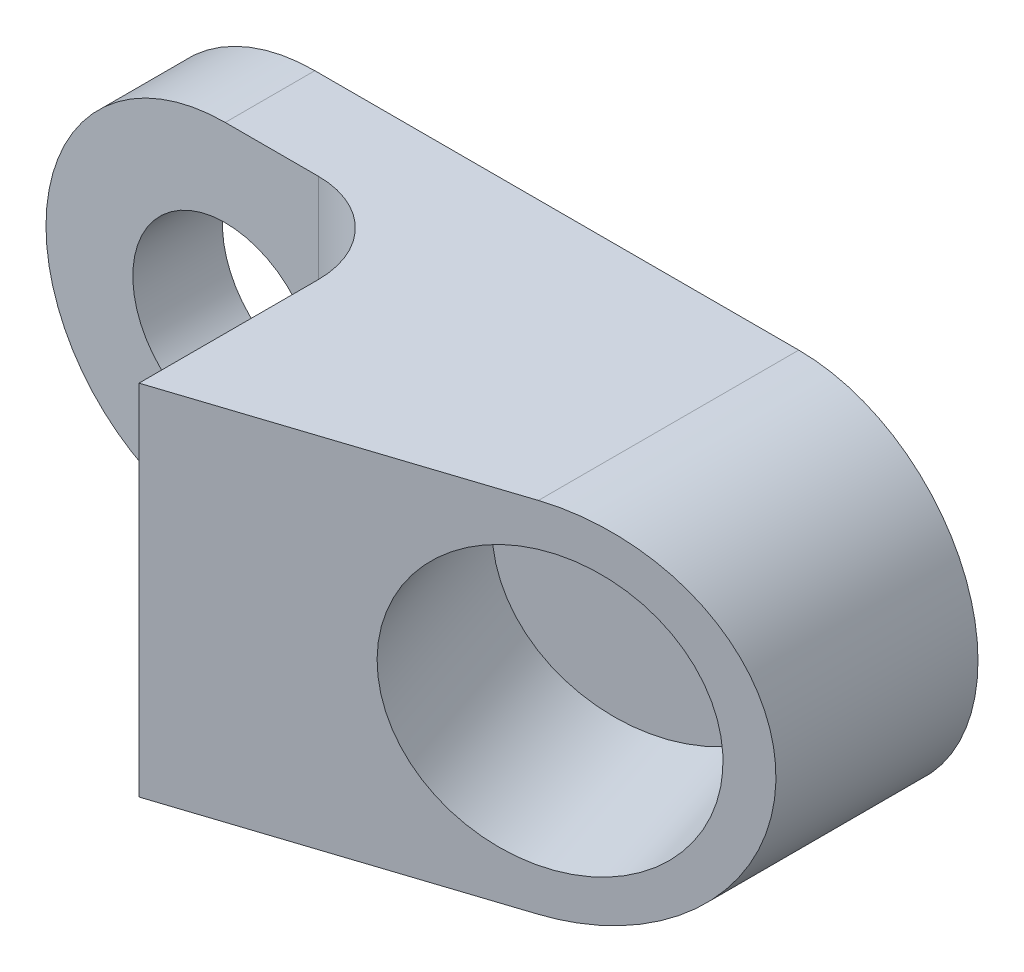
ISO-10303-21;
HEADER;
FILE_DESCRIPTION(('STEP AP214'),'2;1');
FILE_NAME('part.step','',(''),(''),'','','');
FILE_SCHEMA(('AUTOMOTIVE_DESIGN { 1 0 10303 214 1 1 1 1 }'));
ENDSEC;
DATA;
#1=APPLICATION_CONTEXT('core data for automotive mechanical design processes');
#2=APPLICATION_PROTOCOL_DEFINITION('international standard','automotive_design',2000,#1);
#3=PRODUCT_CONTEXT('',#1,'mechanical');
#4=PRODUCT('Part','Part','',(#3));
#5=PRODUCT_RELATED_PRODUCT_CATEGORY('part','',(#4));
#6=PRODUCT_DEFINITION_FORMATION('','',#4);
#7=PRODUCT_DEFINITION_CONTEXT('part definition',#1,'design');
#8=PRODUCT_DEFINITION('design','',#6,#7);
#9=PRODUCT_DEFINITION_SHAPE('','',#8);
#10=(LENGTH_UNIT() NAMED_UNIT(*) SI_UNIT(.MILLI.,.METRE.));
#11=(NAMED_UNIT(*) PLANE_ANGLE_UNIT() SI_UNIT($,.RADIAN.));
#12=(NAMED_UNIT(*) SI_UNIT($,.STERADIAN.) SOLID_ANGLE_UNIT());
#13=UNCERTAINTY_MEASURE_WITH_UNIT(LENGTH_MEASURE(1.E-05),#10,'distance_accuracy_value','');
#14=(GEOMETRIC_REPRESENTATION_CONTEXT(3) GLOBAL_UNCERTAINTY_ASSIGNED_CONTEXT((#13)) GLOBAL_UNIT_ASSIGNED_CONTEXT((#10,
#11,#12)) REPRESENTATION_CONTEXT('',''));
#15=CARTESIAN_POINT('',(0.,0.,0.));
#16=DIRECTION('',(0.,0.,1.));
#17=DIRECTION('',(1.,0.,0.));
#18=AXIS2_PLACEMENT_3D('',#15,#16,#17);
#19=CARTESIAN_POINT('',(21.3482169376562,12.7,0.));
#20=DIRECTION('',(0.,0.,1.));
#21=DIRECTION('',(-0.484934330020351,-0.874550567759071,0.));
#22=AXIS2_PLACEMENT_3D('',#19,#20,#21);
#23=CYLINDRICAL_SURFACE('',#22,12.7);
#24=DIRECTION('',(0.,0.,-1.));
#25=VECTOR('',#24,1.);
#26=CARTESIAN_POINT('',(21.3482169376562,0.,0.));
#27=LINE('',#26,#25);
#28=CARTESIAN_POINT('',(21.3482169376561,0.,0.));
#29=VERTEX_POINT('',#28);
#30=CARTESIAN_POINT('',(21.3482169376562,0.,18.4503189580246));
#31=VERTEX_POINT('',#30);
#32=EDGE_CURVE('E120',#29,#31,#27,.F.);
#33=ORIENTED_EDGE('',*,*,#32,.F.);
#34=CARTESIAN_POINT('',(21.3482169376562,12.7,0.));
#35=DIRECTION('',(0.,0.,1.));
#36=DIRECTION('',(0.874550567759071,-0.484934330020351,0.));
#37=AXIS2_PLACEMENT_3D('',#34,#35,#36);
#38=CIRCLE('',#37,12.7);
#39=CARTESIAN_POINT('',(21.3482169376561,25.4,0.));
#40=VERTEX_POINT('',#39);
#41=EDGE_CURVE('E158',#40,#29,#38,.F.);
#42=ORIENTED_EDGE('',*,*,#41,.F.);
#43=DIRECTION('',(0.,0.,1.));
#44=VECTOR('',#43,1.);
#45=CARTESIAN_POINT('',(21.3482169376561,25.4,-3.17499999999996));
#46=LINE('',#45,#44);
#47=CARTESIAN_POINT('',(21.3482169376561,25.4,18.4503189580246));
#48=VERTEX_POINT('',#47);
#49=EDGE_CURVE('E155',#48,#40,#46,.F.);
#50=ORIENTED_EDGE('',*,*,#49,.F.);
#51=CARTESIAN_POINT('',(21.3482169376561,12.7,18.4503189580246));
#52=DIRECTION('',(-0.309549752931914,0.,-0.950883247543983));
#53=DIRECTION('',(-0.950883247543983,0.,0.309549752931914));
#54=AXIS2_PLACEMENT_3D('',#51,#52,#53);
#55=ELLIPSE('',#54,13.356003518626,12.7);
#56=EDGE_CURVE('E160',#31,#48,#55,.F.);
#57=ORIENTED_EDGE('',*,*,#56,.F.);
#58=EDGE_LOOP('',(#33,#42,#50,#57));
#59=FACE_BOUND('',#58,.T.);
#60=ADVANCED_FACE('F55',(#59),#23,.T.);
#61=CARTESIAN_POINT('',(-12.9417830623439,12.7,0.));
#62=DIRECTION('',(0.,0.,-1.));
#63=DIRECTION('',(0.484934330020351,0.874550567759071,0.));
#64=AXIS2_PLACEMENT_3D('',#61,#62,#63);
#65=CYLINDRICAL_SURFACE('',#64,12.7);
#66=DIRECTION('',(0.,0.,-1.));
#67=VECTOR('',#66,1.);
#68=CARTESIAN_POINT('',(-12.9417830623439,25.4,-3.17500000000003));
#69=LINE('',#68,#67);
#70=CARTESIAN_POINT('',(-12.9417830623439,25.4,0.));
#71=VERTEX_POINT('',#70);
#72=CARTESIAN_POINT('',(-12.941783062344,25.4,6.34999999999997));
#73=VERTEX_POINT('',#72);
#74=EDGE_CURVE('E133',#71,#73,#69,.F.);
#75=ORIENTED_EDGE('',*,*,#74,.F.);
#76=CARTESIAN_POINT('',(-12.9417830623439,12.7,0.));
#77=DIRECTION('',(0.,0.,1.));
#78=DIRECTION('',(0.874550567759071,-0.484934330020351,0.));
#79=AXIS2_PLACEMENT_3D('',#76,#77,#78);
#80=CIRCLE('',#79,12.7);
#81=CARTESIAN_POINT('',(-12.9417830623439,0.,0.));
#82=VERTEX_POINT('',#81);
#83=EDGE_CURVE('E149',#82,#71,#80,.F.);
#84=ORIENTED_EDGE('',*,*,#83,.F.);
#85=DIRECTION('',(0.,0.,1.));
#86=VECTOR('',#85,1.);
#87=CARTESIAN_POINT('',(-12.9417830623439,0.,0.));
#88=LINE('',#87,#86);
#89=CARTESIAN_POINT('',(-12.941783062344,0.,6.34999999999997));
#90=VERTEX_POINT('',#89);
#91=EDGE_CURVE('E137',#90,#82,#88,.F.);
#92=ORIENTED_EDGE('',*,*,#91,.F.);
#93=CARTESIAN_POINT('',(-12.9417830623439,12.7,6.34999999999997));
#94=DIRECTION('',(0.,0.,-1.));
#95=DIRECTION('',(-0.874550567759071,0.484934330020351,0.));
#96=AXIS2_PLACEMENT_3D('',#93,#94,#95);
#97=CIRCLE('',#96,12.7);
#98=EDGE_CURVE('E151',#73,#90,#97,.F.);
#99=ORIENTED_EDGE('',*,*,#98,.F.);
#100=EDGE_LOOP('',(#75,#84,#92,#99));
#101=FACE_BOUND('',#100,.T.);
#102=ADVANCED_FACE('F200',(#101),#65,.T.);
#103=CARTESIAN_POINT('',(215.06235787563,0.,-44.6112236884023));
#104=DIRECTION('',(-0.309549752931914,0.,-0.950883247543983));
#105=DIRECTION('',(-0.841126197567366,0.466400668088372,0.273819532854368));
#106=AXIS2_PLACEMENT_3D('',#103,#104,#105);
#107=PLANE('',#106);
#108=CARTESIAN_POINT('',(21.9719996938476,12.7,18.2472532309114));
#109=DIRECTION('',(0.309549752931914,0.,0.950883247543983));
#110=DIRECTION('',(0.841126197567366,-0.466400668088372,-0.273819532854368));
#111=AXIS2_PLACEMENT_3D('',#108,#109,#110);
#112=CIRCLE('',#111,9.7234375);
#113=CARTESIAN_POINT('',(30.1506377055065,8.16498225388443,15.5847861169228));
#114=VERTEX_POINT('',#113);
#115=EDGE_CURVE('E184',#114,#114,#112,.T.);
#116=ORIENTED_EDGE('',*,*,#115,.F.);
#117=EDGE_LOOP('',(#116));
#118=FACE_BOUND('',#117,.T.);
#119=DIRECTION('',(-0.950883247543983,0.,0.309549752931913));
#120=VECTOR('',#119,1.);
#121=CARTESIAN_POINT('',(215.06235787563,0.,-44.6112236884023));
#122=LINE('',#121,#120);
#123=CARTESIAN_POINT('',(0.,0.,25.4));
#124=VERTEX_POINT('',#123);
#125=EDGE_CURVE('E114',#31,#124,#122,.T.);
#126=ORIENTED_EDGE('',*,*,#125,.F.);
#127=ORIENTED_EDGE('',*,*,#56,.T.);
#128=DIRECTION('',(-0.950883247543983,0.,0.309549752931913));
#129=VECTOR('',#128,1.);
#130=CARTESIAN_POINT('',(215.06235787563,25.4,-44.6112236884023));
#131=LINE('',#130,#129);
#132=CARTESIAN_POINT('',(0.,25.4,25.4));
#133=VERTEX_POINT('',#132);
#134=EDGE_CURVE('E132',#48,#133,#131,.T.);
#135=ORIENTED_EDGE('',*,*,#134,.T.);
#136=DIRECTION('',(0.,1.,0.));
#137=VECTOR('',#136,1.);
#138=CARTESIAN_POINT('',(0.,0.,25.4));
#139=LINE('',#138,#137);
#140=EDGE_CURVE('E127',#124,#133,#139,.T.);
#141=ORIENTED_EDGE('',*,*,#140,.F.);
#142=EDGE_LOOP('',(#126,#127,#135,#141));
#143=FACE_BOUND('',#142,.T.);
#144=ADVANCED_FACE('F130',(#118,#143),#107,.F.);
#145=CARTESIAN_POINT('',(0.,0.,-3.17499999999955));
#146=DIRECTION('',(1.,0.,0.));
#147=DIRECTION('',(0.,1.,0.));
#148=AXIS2_PLACEMENT_3D('',#145,#146,#147);
#149=PLANE('',#148);
#150=DIRECTION('',(0.,0.,-1.));
#151=VECTOR('',#150,1.);
#152=CARTESIAN_POINT('',(0.,25.4,-3.17499999999955));
#153=LINE('',#152,#151);
#154=CARTESIAN_POINT('',(0.,25.4,12.7));
#155=VERTEX_POINT('',#154);
#156=EDGE_CURVE('E175',#133,#155,#153,.T.);
#157=ORIENTED_EDGE('',*,*,#156,.T.);
#158=DIRECTION('',(0.,1.,0.));
#159=VECTOR('',#158,1.);
#160=CARTESIAN_POINT('',(0.,0.,12.7));
#161=LINE('',#160,#159);
#162=CARTESIAN_POINT('',(0.,0.,12.7));
#163=VERTEX_POINT('',#162);
#164=EDGE_CURVE('E70',#155,#163,#161,.F.);
#165=ORIENTED_EDGE('',*,*,#164,.T.);
#166=DIRECTION('',(0.,0.,-1.));
#167=VECTOR('',#166,1.);
#168=CARTESIAN_POINT('',(0.,0.,-3.17499999999955));
#169=LINE('',#168,#167);
#170=EDGE_CURVE('E117',#124,#163,#169,.T.);
#171=ORIENTED_EDGE('',*,*,#170,.F.);
#172=ORIENTED_EDGE('',*,*,#140,.T.);
#173=EDGE_LOOP('',(#157,#165,#171,#172));
#174=FACE_BOUND('',#173,.T.);
#175=ADVANCED_FACE('F126',(#174),#149,.F.);
#176=CARTESIAN_POINT('',(228.551472168374,0.,6.35000000000046));
#177=DIRECTION('',(0.,0.,-1.));
#178=DIRECTION('',(-0.874550567759071,0.484934330020351,0.));
#179=AXIS2_PLACEMENT_3D('',#176,#177,#178);
#180=PLANE('',#179);
#181=CARTESIAN_POINT('',(-12.9417830623438,12.7,6.34999999999997));
#182=DIRECTION('',(0.,0.,1.));
#183=DIRECTION('',(0.874550567759071,-0.484934330020351,0.));
#184=AXIS2_PLACEMENT_3D('',#181,#182,#183);
#185=CIRCLE('',#184,6.5484375);
#186=CARTESIAN_POINT('',(-7.21484332878405,9.52443784825733,6.34999999999998));
#187=VERTEX_POINT('',#186);
#188=EDGE_CURVE('E145',#187,#187,#185,.T.);
#189=ORIENTED_EDGE('',*,*,#188,.F.);
#190=EDGE_LOOP('',(#189));
#191=FACE_BOUND('',#190,.T.);
#192=DIRECTION('',(-1.,0.,0.));
#193=VECTOR('',#192,1.);
#194=CARTESIAN_POINT('',(228.551472168374,0.,6.35000000000046));
#195=LINE('',#194,#193);
#196=CARTESIAN_POINT('',(-6.35000000000013,0.,6.34999999999999));
#197=VERTEX_POINT('',#196);
#198=EDGE_CURVE('E128',#197,#90,#195,.T.);
#199=ORIENTED_EDGE('',*,*,#198,.F.);
#200=DIRECTION('',(0.,1.,0.));
#201=VECTOR('',#200,1.);
#202=CARTESIAN_POINT('',(-6.35000000000002,25.4,6.34999999999999));
#203=LINE('',#202,#201);
#204=CARTESIAN_POINT('',(-6.35000000000011,25.4,6.34999999999999));
#205=VERTEX_POINT('',#204);
#206=EDGE_CURVE('E162',#197,#205,#203,.T.);
#207=ORIENTED_EDGE('',*,*,#206,.T.);
#208=DIRECTION('',(-1.,0.,0.));
#209=VECTOR('',#208,1.);
#210=CARTESIAN_POINT('',(228.551472168374,25.4,6.35000000000046));
#211=LINE('',#210,#209);
#212=EDGE_CURVE('E169',#205,#73,#211,.T.);
#213=ORIENTED_EDGE('',*,*,#212,.T.);
#214=ORIENTED_EDGE('',*,*,#98,.T.);
#215=EDGE_LOOP('',(#199,#207,#213,#214));
#216=FACE_BOUND('',#215,.T.);
#217=ADVANCED_FACE('F168',(#191,#216),#180,.F.);
#218=CARTESIAN_POINT('',(228.551472168374,0.,4.90493062832442E-13));
#219=DIRECTION('',(0.,0.,1.));
#220=DIRECTION('',(0.874550567759071,-0.484934330020351,0.));
#221=AXIS2_PLACEMENT_3D('',#218,#219,#220);
#222=PLANE('',#221);
#223=CARTESIAN_POINT('',(-12.9417830623438,12.7,0.));
#224=DIRECTION('',(0.,0.,1.));
#225=DIRECTION('',(0.874550567759071,-0.484934330020351,0.));
#226=AXIS2_PLACEMENT_3D('',#223,#224,#225);
#227=CIRCLE('',#226,6.5484375);
#228=CARTESIAN_POINT('',(-7.21484332878402,9.52443784825733,0.));
#229=VERTEX_POINT('',#228);
#230=EDGE_CURVE('E143',#229,#229,#227,.T.);
#231=ORIENTED_EDGE('',*,*,#230,.T.);
#232=EDGE_LOOP('',(#231));
#233=FACE_BOUND('',#232,.T.);
#234=DIRECTION('',(1.,0.,0.));
#235=VECTOR('',#234,1.);
#236=CARTESIAN_POINT('',(228.551472168374,25.4,4.91360424570431E-13));
#237=LINE('',#236,#235);
#238=EDGE_CURVE('E123',#71,#40,#237,.T.);
#239=ORIENTED_EDGE('',*,*,#238,.T.);
#240=ORIENTED_EDGE('',*,*,#41,.T.);
#241=DIRECTION('',(1.,0.,0.));
#242=VECTOR('',#241,1.);
#243=CARTESIAN_POINT('',(228.551472168374,0.,4.90493062832442E-13));
#244=LINE('',#243,#242);
#245=EDGE_CURVE('E134',#82,#29,#244,.T.);
#246=ORIENTED_EDGE('',*,*,#245,.F.);
#247=ORIENTED_EDGE('',*,*,#83,.T.);
#248=EDGE_LOOP('',(#239,#240,#246,#247));
#249=FACE_BOUND('',#248,.T.);
#250=ADVANCED_FACE('F223',(#233,#249),#222,.F.);
#251=CARTESIAN_POINT('',(228.551472168374,0.,-3.17499999999954));
#252=DIRECTION('',(0.,-1.,0.));
#253=DIRECTION('',(1.,0.,0.));
#254=AXIS2_PLACEMENT_3D('',#251,#252,#253);
#255=PLANE('',#254);
#256=ORIENTED_EDGE('',*,*,#245,.T.);
#257=ORIENTED_EDGE('',*,*,#32,.T.);
#258=ORIENTED_EDGE('',*,*,#125,.T.);
#259=ORIENTED_EDGE('',*,*,#170,.T.);
#260=CARTESIAN_POINT('',(-6.35000000000002,0.,12.7));
#261=DIRECTION('',(0.,-1.,0.));
#262=DIRECTION('',(1.,0.,0.));
#263=AXIS2_PLACEMENT_3D('',#260,#261,#262);
#264=CIRCLE('',#263,6.35);
#265=EDGE_CURVE('E13',#163,#197,#264,.F.);
#266=ORIENTED_EDGE('',*,*,#265,.T.);
#267=ORIENTED_EDGE('',*,*,#198,.T.);
#268=ORIENTED_EDGE('',*,*,#91,.T.);
#269=EDGE_LOOP('',(#256,#257,#258,#259,#266,#267,#268));
#270=FACE_BOUND('',#269,.T.);
#271=ADVANCED_FACE('F116',(#270),#255,.T.);
#272=CARTESIAN_POINT('',(228.551472168374,25.4,-3.17499999999954));
#273=DIRECTION('',(0.,-1.,0.));
#274=DIRECTION('',(1.,0.,0.));
#275=AXIS2_PLACEMENT_3D('',#272,#273,#274);
#276=PLANE('',#275);
#277=ORIENTED_EDGE('',*,*,#134,.F.);
#278=ORIENTED_EDGE('',*,*,#49,.T.);
#279=ORIENTED_EDGE('',*,*,#238,.F.);
#280=ORIENTED_EDGE('',*,*,#74,.T.);
#281=ORIENTED_EDGE('',*,*,#212,.F.);
#282=CARTESIAN_POINT('',(-6.35000000000002,25.4,12.7));
#283=DIRECTION('',(0.,-1.,0.));
#284=DIRECTION('',(1.,0.,0.));
#285=AXIS2_PLACEMENT_3D('',#282,#283,#284);
#286=CIRCLE('',#285,6.35);
#287=EDGE_CURVE('E63',#205,#155,#286,.T.);
#288=ORIENTED_EDGE('',*,*,#287,.T.);
#289=ORIENTED_EDGE('',*,*,#156,.F.);
#290=EDGE_LOOP('',(#277,#278,#279,#280,#281,#288,#289));
#291=FACE_BOUND('',#290,.T.);
#292=ADVANCED_FACE('F172',(#291),#276,.F.);
#293=CARTESIAN_POINT('',(-12.9417830623438,12.7,-6.1234613966766));
#294=DIRECTION('',(0.,0.,1.));
#295=DIRECTION('',(0.874550567759071,-0.484934330020351,0.));
#296=AXIS2_PLACEMENT_3D('',#293,#294,#295);
#297=CYLINDRICAL_SURFACE('',#296,6.5484375);
#298=ORIENTED_EDGE('',*,*,#188,.T.);
#299=EDGE_LOOP('',(#298));
#300=FACE_BOUND('',#299,.T.);
#301=ORIENTED_EDGE('',*,*,#230,.F.);
#302=EDGE_LOOP('',(#301));
#303=FACE_BOUND('',#302,.T.);
#304=ADVANCED_FACE('F195',(#300,#303),#297,.F.);
#305=CARTESIAN_POINT('',(18.0407178316123,12.7,6.17103598710283));
#306=DIRECTION('',(0.309549752931914,0.,0.950883247543983));
#307=DIRECTION('',(0.841126197567366,-0.466400668088372,-0.273819532854368));
#308=AXIS2_PLACEMENT_3D('',#305,#306,#307);
#309=CYLINDRICAL_SURFACE('',#308,9.7234375);
#310=CARTESIAN_POINT('',(18.0407178316123,12.7,6.17103598710283));
#311=DIRECTION('',(0.309549752931914,0.,0.950883247543983));
#312=DIRECTION('',(0.841126197567366,-0.466400668088372,-0.273819532854368));
#313=AXIS2_PLACEMENT_3D('',#310,#311,#312);
#314=CIRCLE('',#313,9.7234375);
#315=CARTESIAN_POINT('',(26.2193558432713,8.16498225388443,3.50856887311418));
#316=VERTEX_POINT('',#315);
#317=EDGE_CURVE('E183',#316,#316,#314,.T.);
#318=ORIENTED_EDGE('',*,*,#317,.F.);
#319=EDGE_LOOP('',(#318));
#320=FACE_BOUND('',#319,.T.);
#321=ORIENTED_EDGE('',*,*,#115,.T.);
#322=EDGE_LOOP('',(#321));
#323=FACE_BOUND('',#322,.T.);
#324=ADVANCED_FACE('F192',(#320,#323),#309,.F.);
#325=CARTESIAN_POINT('',(18.0407178316123,12.7,6.17103598710283));
#326=DIRECTION('',(0.309549752931914,0.,0.950883247543983));
#327=DIRECTION('',(0.841126197567366,-0.466400668088372,-0.273819532854368));
#328=AXIS2_PLACEMENT_3D('',#325,#326,#327);
#329=PLANE('',#328);
#330=ORIENTED_EDGE('',*,*,#317,.T.);
#331=EDGE_LOOP('',(#330));
#332=FACE_BOUND('',#331,.T.);
#333=ADVANCED_FACE('F190',(#332),#329,.T.);
#334=CARTESIAN_POINT('',(-6.35000000000002,0.,12.7));
#335=DIRECTION('',(0.,-1.,0.));
#336=DIRECTION('',(1.,0.,0.));
#337=AXIS2_PLACEMENT_3D('',#334,#335,#336);
#338=CYLINDRICAL_SURFACE('',#337,6.35);
#339=ORIENTED_EDGE('',*,*,#265,.F.);
#340=ORIENTED_EDGE('',*,*,#164,.F.);
#341=ORIENTED_EDGE('',*,*,#287,.F.);
#342=ORIENTED_EDGE('',*,*,#206,.F.);
#343=EDGE_LOOP('',(#339,#340,#341,#342));
#344=FACE_BOUND('',#343,.T.);
#345=ADVANCED_FACE('F57',(#344),#338,.F.);
#346=CLOSED_SHELL('',(#60,#102,#144,#175,#217,#250,#271,#292,#304,#324,#333,#345));
#347=MANIFOLD_SOLID_BREP('B2',#346);
#348=ADVANCED_BREP_SHAPE_REPRESENTATION('',(#18,#347),#14);
#349=SHAPE_DEFINITION_REPRESENTATION(#9,#348);
ENDSEC;
END-ISO-10303-21;
